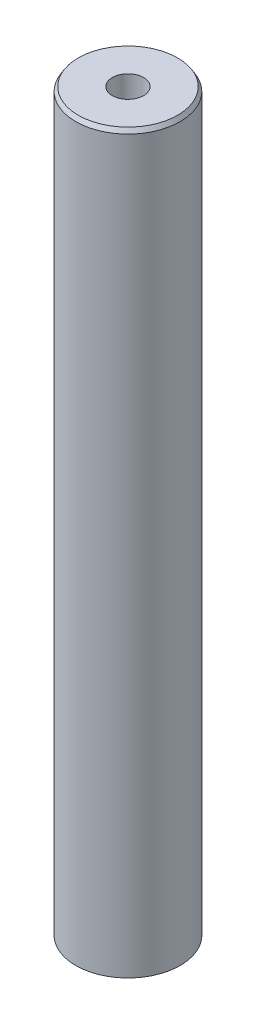
ISO-10303-21;
HEADER;
FILE_DESCRIPTION(('STEP AP214'),'2;1');
FILE_NAME('part.step','',(''),(''),'','','');
FILE_SCHEMA(('AUTOMOTIVE_DESIGN { 1 0 10303 214 1 1 1 1 }'));
ENDSEC;
DATA;
#1=APPLICATION_CONTEXT('core data for automotive mechanical design processes');
#2=APPLICATION_PROTOCOL_DEFINITION('international standard','automotive_design',2000,#1);
#3=PRODUCT_CONTEXT('',#1,'mechanical');
#4=PRODUCT('Part','Part','',(#3));
#5=PRODUCT_RELATED_PRODUCT_CATEGORY('part','',(#4));
#6=PRODUCT_DEFINITION_FORMATION('','',#4);
#7=PRODUCT_DEFINITION_CONTEXT('part definition',#1,'design');
#8=PRODUCT_DEFINITION('design','',#6,#7);
#9=PRODUCT_DEFINITION_SHAPE('','',#8);
#10=(LENGTH_UNIT() NAMED_UNIT(*) SI_UNIT(.MILLI.,.METRE.));
#11=(NAMED_UNIT(*) PLANE_ANGLE_UNIT() SI_UNIT($,.RADIAN.));
#12=(NAMED_UNIT(*) SI_UNIT($,.STERADIAN.) SOLID_ANGLE_UNIT());
#13=UNCERTAINTY_MEASURE_WITH_UNIT(LENGTH_MEASURE(1.E-05),#10,'distance_accuracy_value','');
#14=(GEOMETRIC_REPRESENTATION_CONTEXT(3) GLOBAL_UNCERTAINTY_ASSIGNED_CONTEXT((#13)) GLOBAL_UNIT_ASSIGNED_CONTEXT((#10,
#11,#12)) REPRESENTATION_CONTEXT('',''));
#15=CARTESIAN_POINT('',(0.,0.,0.));
#16=DIRECTION('',(0.,0.,1.));
#17=DIRECTION('',(1.,0.,0.));
#18=AXIS2_PLACEMENT_3D('',#15,#16,#17);
#19=CARTESIAN_POINT('',(0.,600.,0.));
#20=DIRECTION('',(0.,-1.,0.));
#21=DIRECTION('',(0.,0.,-1.));
#22=AXIS2_PLACEMENT_3D('',#19,#20,#21);
#23=CYLINDRICAL_SURFACE('',#22,42.5);
#24=CARTESIAN_POINT('',(0.,596.543837182951,0.));
#25=DIRECTION('',(0.,1.,0.));
#26=DIRECTION('',(0.,0.,1.));
#27=AXIS2_PLACEMENT_3D('',#24,#25,#26);
#28=CIRCLE('',#27,42.5);
#29=CARTESIAN_POINT('',(0.,596.543837182951,42.5));
#30=VERTEX_POINT('',#29);
#31=EDGE_CURVE('E50',#30,#30,#28,.F.);
#32=ORIENTED_EDGE('',*,*,#31,.T.);
#33=EDGE_LOOP('',(#32));
#34=FACE_BOUND('',#33,.T.);
#35=CARTESIAN_POINT('',(0.,2.08228847898417,0.));
#36=DIRECTION('',(0.,1.,0.));
#37=DIRECTION('',(0.,0.,1.));
#38=AXIS2_PLACEMENT_3D('',#35,#36,#37);
#39=CIRCLE('',#38,42.5);
#40=CARTESIAN_POINT('',(0.,2.08228847898417,42.5));
#41=VERTEX_POINT('',#40);
#42=EDGE_CURVE('E51',#41,#41,#39,.T.);
#43=ORIENTED_EDGE('',*,*,#42,.T.);
#44=EDGE_LOOP('',(#43));
#45=FACE_BOUND('',#44,.T.);
#46=ADVANCED_FACE('F39',(#34,#45),#23,.T.);
#47=CARTESIAN_POINT('',(0.,600.,0.));
#48=DIRECTION('',(0.,1.,0.));
#49=DIRECTION('',(0.,0.,1.));
#50=AXIS2_PLACEMENT_3D('',#47,#48,#49);
#51=PLANE('',#50);
#52=CARTESIAN_POINT('',(0.,600.,0.));
#53=DIRECTION('',(0.,1.,0.));
#54=DIRECTION('',(0.,0.,1.));
#55=AXIS2_PLACEMENT_3D('',#52,#53,#54);
#56=CIRCLE('',#55,40.4177115210158);
#57=CARTESIAN_POINT('',(0.,600.,40.4177115210158));
#58=VERTEX_POINT('',#57);
#59=EDGE_CURVE('E54',#58,#58,#56,.T.);
#60=ORIENTED_EDGE('',*,*,#59,.T.);
#61=EDGE_LOOP('',(#60));
#62=FACE_BOUND('',#61,.T.);
#63=CARTESIAN_POINT('',(0.,600.,0.));
#64=DIRECTION('',(0.,1.,0.));
#65=DIRECTION('',(0.,0.,1.));
#66=AXIS2_PLACEMENT_3D('',#63,#64,#65);
#67=CIRCLE('',#66,12.7580989864095);
#68=CARTESIAN_POINT('',(0.,600.,12.7580989864095));
#69=VERTEX_POINT('',#68);
#70=EDGE_CURVE('E58',#69,#69,#67,.T.);
#71=ORIENTED_EDGE('',*,*,#70,.F.);
#72=EDGE_LOOP('',(#71));
#73=FACE_BOUND('',#72,.T.);
#74=ADVANCED_FACE('F69',(#62,#73),#51,.T.);
#75=CARTESIAN_POINT('',(0.,0.,0.));
#76=DIRECTION('',(0.,1.,0.));
#77=DIRECTION('',(0.,0.,1.));
#78=AXIS2_PLACEMENT_3D('',#75,#76,#77);
#79=PLANE('',#78);
#80=CARTESIAN_POINT('',(0.,0.,0.));
#81=DIRECTION('',(0.,1.,0.));
#82=DIRECTION('',(0.,0.,1.));
#83=AXIS2_PLACEMENT_3D('',#80,#81,#82);
#84=CIRCLE('',#83,39.0438371829507);
#85=CARTESIAN_POINT('',(0.,0.,39.0438371829507));
#86=VERTEX_POINT('',#85);
#87=EDGE_CURVE('E10',#86,#86,#84,.F.);
#88=ORIENTED_EDGE('',*,*,#87,.T.);
#89=EDGE_LOOP('',(#88));
#90=FACE_BOUND('',#89,.T.);
#91=CARTESIAN_POINT('',(0.,0.,0.));
#92=DIRECTION('',(0.,1.,0.));
#93=DIRECTION('',(0.,0.,1.));
#94=AXIS2_PLACEMENT_3D('',#91,#92,#93);
#95=CIRCLE('',#94,12.7580989864095);
#96=CARTESIAN_POINT('',(0.,0.,12.7580989864095));
#97=VERTEX_POINT('',#96);
#98=EDGE_CURVE('E63',#97,#97,#95,.T.);
#99=ORIENTED_EDGE('',*,*,#98,.T.);
#100=EDGE_LOOP('',(#99));
#101=FACE_BOUND('',#100,.T.);
#102=ADVANCED_FACE('F75',(#90,#101),#79,.F.);
#103=CARTESIAN_POINT('',(0.,600.,0.));
#104=DIRECTION('',(0.,-1.,0.));
#105=DIRECTION('',(0.,0.,-1.));
#106=AXIS2_PLACEMENT_3D('',#103,#104,#105);
#107=CYLINDRICAL_SURFACE('',#106,12.7580989864095);
#108=ORIENTED_EDGE('',*,*,#70,.T.);
#109=EDGE_LOOP('',(#108));
#110=FACE_BOUND('',#109,.T.);
#111=ORIENTED_EDGE('',*,*,#98,.F.);
#112=EDGE_LOOP('',(#111));
#113=FACE_BOUND('',#112,.T.);
#114=ADVANCED_FACE('F70',(#110,#113),#107,.F.);
#115=CARTESIAN_POINT('',(0.,600.,0.));
#116=DIRECTION('',(0.,-1.,0.));
#117=DIRECTION('',(0.,0.,-1.));
#118=AXIS2_PLACEMENT_3D('',#115,#116,#117);
#119=CONICAL_SURFACE('',#118,40.4177115210158,0.542245175259458);
#120=ORIENTED_EDGE('',*,*,#31,.F.);
#121=EDGE_LOOP('',(#120));
#122=FACE_BOUND('',#121,.T.);
#123=ORIENTED_EDGE('',*,*,#59,.F.);
#124=EDGE_LOOP('',(#123));
#125=FACE_BOUND('',#124,.T.);
#126=ADVANCED_FACE('F81',(#122,#125),#119,.T.);
#127=CARTESIAN_POINT('',(0.,2.08228847898417,0.));
#128=DIRECTION('',(0.,1.,0.));
#129=DIRECTION('',(0.,0.,1.));
#130=AXIS2_PLACEMENT_3D('',#127,#128,#129);
#131=CONICAL_SURFACE('',#130,42.5,1.02855115153544);
#132=ORIENTED_EDGE('',*,*,#87,.F.);
#133=EDGE_LOOP('',(#132));
#134=FACE_BOUND('',#133,.T.);
#135=ORIENTED_EDGE('',*,*,#42,.F.);
#136=EDGE_LOOP('',(#135));
#137=FACE_BOUND('',#136,.T.);
#138=ADVANCED_FACE('F45',(#134,#137),#131,.T.);
#139=CLOSED_SHELL('',(#46,#74,#102,#114,#126,#138));
#140=MANIFOLD_SOLID_BREP('B2',#139);
#141=ADVANCED_BREP_SHAPE_REPRESENTATION('',(#18,#140),#14);
#142=SHAPE_DEFINITION_REPRESENTATION(#9,#141);
ENDSEC;
END-ISO-10303-21;
